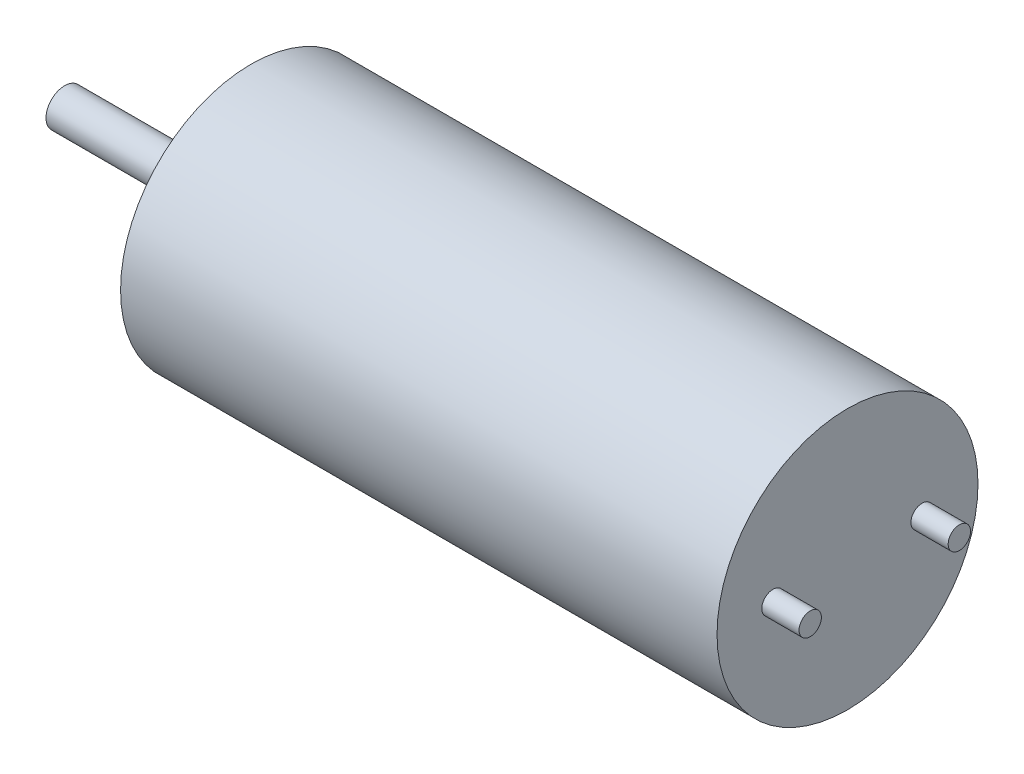
ISO-10303-21;
HEADER;
FILE_DESCRIPTION(('STEP AP214'),'2;1');
FILE_NAME('part.step','',(''),(''),'','','');
FILE_SCHEMA(('AUTOMOTIVE_DESIGN { 1 0 10303 214 1 1 1 1 }'));
ENDSEC;
DATA;
#1=APPLICATION_CONTEXT('core data for automotive mechanical design processes');
#2=APPLICATION_PROTOCOL_DEFINITION('international standard','automotive_design',2000,#1);
#3=PRODUCT_CONTEXT('',#1,'mechanical');
#4=PRODUCT('Part','Part','',(#3));
#5=PRODUCT_RELATED_PRODUCT_CATEGORY('part','',(#4));
#6=PRODUCT_DEFINITION_FORMATION('','',#4);
#7=PRODUCT_DEFINITION_CONTEXT('part definition',#1,'design');
#8=PRODUCT_DEFINITION('design','',#6,#7);
#9=PRODUCT_DEFINITION_SHAPE('','',#8);
#10=(LENGTH_UNIT() NAMED_UNIT(*) SI_UNIT(.MILLI.,.METRE.));
#11=(NAMED_UNIT(*) PLANE_ANGLE_UNIT() SI_UNIT($,.RADIAN.));
#12=(NAMED_UNIT(*) SI_UNIT($,.STERADIAN.) SOLID_ANGLE_UNIT());
#13=UNCERTAINTY_MEASURE_WITH_UNIT(LENGTH_MEASURE(1.E-05),#10,'distance_accuracy_value','');
#14=(GEOMETRIC_REPRESENTATION_CONTEXT(3) GLOBAL_UNCERTAINTY_ASSIGNED_CONTEXT((#13)) GLOBAL_UNIT_ASSIGNED_CONTEXT((#10,
#11,#12)) REPRESENTATION_CONTEXT('',''));
#15=CARTESIAN_POINT('',(0.,0.,0.));
#16=DIRECTION('',(0.,0.,1.));
#17=DIRECTION('',(1.,0.,0.));
#18=AXIS2_PLACEMENT_3D('',#15,#16,#17);
#19=CARTESIAN_POINT('',(16.,0.,0.));
#20=DIRECTION('',(-1.,0.,0.));
#21=DIRECTION('',(0.,0.,1.));
#22=AXIS2_PLACEMENT_3D('',#19,#20,#21);
#23=CYLINDRICAL_SURFACE('',#22,3.5);
#24=CARTESIAN_POINT('',(16.,0.,0.));
#25=DIRECTION('',(1.,0.,0.));
#26=DIRECTION('',(0.,0.,-1.));
#27=AXIS2_PLACEMENT_3D('',#24,#25,#26);
#28=CIRCLE('',#27,3.5);
#29=CARTESIAN_POINT('',(16.,0.,-3.5));
#30=VERTEX_POINT('',#29);
#31=EDGE_CURVE('E47',#30,#30,#28,.T.);
#32=ORIENTED_EDGE('',*,*,#31,.F.);
#33=EDGE_LOOP('',(#32));
#34=FACE_BOUND('',#33,.T.);
#35=CARTESIAN_POINT('',(0.,0.,0.));
#36=DIRECTION('',(1.,0.,0.));
#37=DIRECTION('',(0.,0.,-1.));
#38=AXIS2_PLACEMENT_3D('',#35,#36,#37);
#39=CIRCLE('',#38,3.5);
#40=CARTESIAN_POINT('',(0.,0.,-3.5));
#41=VERTEX_POINT('',#40);
#42=EDGE_CURVE('E38',#41,#41,#39,.T.);
#43=ORIENTED_EDGE('',*,*,#42,.T.);
#44=EDGE_LOOP('',(#43));
#45=FACE_BOUND('',#44,.T.);
#46=ADVANCED_FACE('F35',(#34,#45),#23,.T.);
#47=CARTESIAN_POINT('',(16.,0.,0.));
#48=DIRECTION('',(1.,0.,0.));
#49=DIRECTION('',(0.,0.,-1.));
#50=AXIS2_PLACEMENT_3D('',#47,#48,#49);
#51=PLANE('',#50);
#52=CARTESIAN_POINT('',(16.,0.,-2.));
#53=DIRECTION('',(1.,0.,0.));
#54=DIRECTION('',(0.,0.,-1.));
#55=AXIS2_PLACEMENT_3D('',#52,#53,#54);
#56=CIRCLE('',#55,0.3);
#57=CARTESIAN_POINT('',(16.,0.,-2.3));
#58=VERTEX_POINT('',#57);
#59=EDGE_CURVE('E182',#58,#58,#56,.T.);
#60=ORIENTED_EDGE('',*,*,#59,.F.);
#61=EDGE_LOOP('',(#60));
#62=FACE_BOUND('',#61,.T.);
#63=CARTESIAN_POINT('',(16.,0.,2.));
#64=DIRECTION('',(1.,0.,0.));
#65=DIRECTION('',(0.,0.,-1.));
#66=AXIS2_PLACEMENT_3D('',#63,#64,#65);
#67=CIRCLE('',#66,0.3);
#68=CARTESIAN_POINT('',(16.,0.,1.7));
#69=VERTEX_POINT('',#68);
#70=EDGE_CURVE('E176',#69,#69,#67,.T.);
#71=ORIENTED_EDGE('',*,*,#70,.F.);
#72=EDGE_LOOP('',(#71));
#73=FACE_BOUND('',#72,.T.);
#74=ORIENTED_EDGE('',*,*,#31,.T.);
#75=EDGE_LOOP('',(#74));
#76=FACE_BOUND('',#75,.T.);
#77=ADVANCED_FACE('F65',(#62,#73,#76),#51,.T.);
#78=CARTESIAN_POINT('',(0.,0.,0.));
#79=DIRECTION('',(1.,0.,0.));
#80=DIRECTION('',(0.,0.,-1.));
#81=AXIS2_PLACEMENT_3D('',#78,#79,#80);
#82=PLANE('',#81);
#83=CARTESIAN_POINT('',(0.,0.,0.));
#84=DIRECTION('',(-1.,0.,0.));
#85=DIRECTION('',(0.,0.,1.));
#86=AXIS2_PLACEMENT_3D('',#83,#84,#85);
#87=CIRCLE('',#86,1.2);
#88=CARTESIAN_POINT('',(0.,0.,1.2));
#89=VERTEX_POINT('',#88);
#90=EDGE_CURVE('E42',#89,#89,#87,.T.);
#91=ORIENTED_EDGE('',*,*,#90,.F.);
#92=EDGE_LOOP('',(#91));
#93=FACE_BOUND('',#92,.T.);
#94=ORIENTED_EDGE('',*,*,#42,.F.);
#95=EDGE_LOOP('',(#94));
#96=FACE_BOUND('',#95,.T.);
#97=ADVANCED_FACE('F62',(#93,#96),#82,.F.);
#98=CARTESIAN_POINT('',(-0.8,0.,0.));
#99=DIRECTION('',(1.,0.,0.));
#100=DIRECTION('',(0.,0.,-1.));
#101=AXIS2_PLACEMENT_3D('',#98,#99,#100);
#102=CYLINDRICAL_SURFACE('',#101,1.2);
#103=CARTESIAN_POINT('',(-0.8,0.,0.));
#104=DIRECTION('',(-1.,0.,0.));
#105=DIRECTION('',(0.,0.,1.));
#106=AXIS2_PLACEMENT_3D('',#103,#104,#105);
#107=CIRCLE('',#106,1.2);
#108=CARTESIAN_POINT('',(-0.8,0.,1.2));
#109=VERTEX_POINT('',#108);
#110=EDGE_CURVE('E53',#109,#109,#107,.T.);
#111=ORIENTED_EDGE('',*,*,#110,.F.);
#112=EDGE_LOOP('',(#111));
#113=FACE_BOUND('',#112,.T.);
#114=ORIENTED_EDGE('',*,*,#90,.T.);
#115=EDGE_LOOP('',(#114));
#116=FACE_BOUND('',#115,.T.);
#117=ADVANCED_FACE('F64',(#113,#116),#102,.T.);
#118=CARTESIAN_POINT('',(-0.8,0.,0.));
#119=DIRECTION('',(-1.,0.,0.));
#120=DIRECTION('',(0.,0.,1.));
#121=AXIS2_PLACEMENT_3D('',#118,#119,#120);
#122=PLANE('',#121);
#123=CARTESIAN_POINT('',(-0.8,0.,0.));
#124=DIRECTION('',(-1.,0.,0.));
#125=DIRECTION('',(0.,0.,1.));
#126=AXIS2_PLACEMENT_3D('',#123,#124,#125);
#127=CIRCLE('',#126,0.5);
#128=CARTESIAN_POINT('',(-0.8,0.,0.5));
#129=VERTEX_POINT('',#128);
#130=EDGE_CURVE('E10',#129,#129,#127,.T.);
#131=ORIENTED_EDGE('',*,*,#130,.F.);
#132=EDGE_LOOP('',(#131));
#133=FACE_BOUND('',#132,.T.);
#134=ORIENTED_EDGE('',*,*,#110,.T.);
#135=EDGE_LOOP('',(#134));
#136=FACE_BOUND('',#135,.T.);
#137=ADVANCED_FACE('F71',(#133,#136),#122,.T.);
#138=CARTESIAN_POINT('',(-5.,0.,0.));
#139=DIRECTION('',(1.,0.,0.));
#140=DIRECTION('',(0.,0.,-1.));
#141=AXIS2_PLACEMENT_3D('',#138,#139,#140);
#142=CYLINDRICAL_SURFACE('',#141,0.5);
#143=CARTESIAN_POINT('',(-5.,0.,0.));
#144=DIRECTION('',(-1.,0.,0.));
#145=DIRECTION('',(0.,0.,1.));
#146=AXIS2_PLACEMENT_3D('',#143,#144,#145);
#147=CIRCLE('',#146,0.5);
#148=CARTESIAN_POINT('',(-5.,0.,0.5));
#149=VERTEX_POINT('',#148);
#150=EDGE_CURVE('E51',#149,#149,#147,.T.);
#151=ORIENTED_EDGE('',*,*,#150,.F.);
#152=EDGE_LOOP('',(#151));
#153=FACE_BOUND('',#152,.T.);
#154=ORIENTED_EDGE('',*,*,#130,.T.);
#155=EDGE_LOOP('',(#154));
#156=FACE_BOUND('',#155,.T.);
#157=ADVANCED_FACE('F139',(#153,#156),#142,.T.);
#158=CARTESIAN_POINT('',(-5.,0.,0.));
#159=DIRECTION('',(-1.,0.,0.));
#160=DIRECTION('',(0.,0.,1.));
#161=AXIS2_PLACEMENT_3D('',#158,#159,#160);
#162=PLANE('',#161);
#163=ORIENTED_EDGE('',*,*,#150,.T.);
#164=EDGE_LOOP('',(#163));
#165=FACE_BOUND('',#164,.T.);
#166=ADVANCED_FACE('F92',(#165),#162,.T.);
#167=CARTESIAN_POINT('',(17.,0.,2.));
#168=DIRECTION('',(-1.,0.,0.));
#169=DIRECTION('',(0.,0.,1.));
#170=AXIS2_PLACEMENT_3D('',#167,#168,#169);
#171=CYLINDRICAL_SURFACE('',#170,0.3);
#172=CARTESIAN_POINT('',(17.,0.,2.));
#173=DIRECTION('',(1.,0.,0.));
#174=DIRECTION('',(0.,0.,-1.));
#175=AXIS2_PLACEMENT_3D('',#172,#173,#174);
#176=CIRCLE('',#175,0.3);
#177=CARTESIAN_POINT('',(17.,0.,1.7));
#178=VERTEX_POINT('',#177);
#179=EDGE_CURVE('E174',#178,#178,#176,.T.);
#180=ORIENTED_EDGE('',*,*,#179,.F.);
#181=EDGE_LOOP('',(#180));
#182=FACE_BOUND('',#181,.T.);
#183=ORIENTED_EDGE('',*,*,#70,.T.);
#184=EDGE_LOOP('',(#183));
#185=FACE_BOUND('',#184,.T.);
#186=ADVANCED_FACE('F97',(#182,#185),#171,.T.);
#187=CARTESIAN_POINT('',(17.,0.,2.));
#188=DIRECTION('',(1.,0.,0.));
#189=DIRECTION('',(0.,0.,-1.));
#190=AXIS2_PLACEMENT_3D('',#187,#188,#189);
#191=PLANE('',#190);
#192=ORIENTED_EDGE('',*,*,#179,.T.);
#193=EDGE_LOOP('',(#192));
#194=FACE_BOUND('',#193,.T.);
#195=ADVANCED_FACE('F102',(#194),#191,.T.);
#196=CARTESIAN_POINT('',(17.,0.,-2.));
#197=DIRECTION('',(-1.,0.,0.));
#198=DIRECTION('',(0.,0.,1.));
#199=AXIS2_PLACEMENT_3D('',#196,#197,#198);
#200=CYLINDRICAL_SURFACE('',#199,0.3);
#201=CARTESIAN_POINT('',(17.,0.,-2.));
#202=DIRECTION('',(1.,0.,0.));
#203=DIRECTION('',(0.,0.,-1.));
#204=AXIS2_PLACEMENT_3D('',#201,#202,#203);
#205=CIRCLE('',#204,0.3);
#206=CARTESIAN_POINT('',(17.,0.,-2.3));
#207=VERTEX_POINT('',#206);
#208=EDGE_CURVE('E180',#207,#207,#205,.T.);
#209=ORIENTED_EDGE('',*,*,#208,.F.);
#210=EDGE_LOOP('',(#209));
#211=FACE_BOUND('',#210,.T.);
#212=ORIENTED_EDGE('',*,*,#59,.T.);
#213=EDGE_LOOP('',(#212));
#214=FACE_BOUND('',#213,.T.);
#215=ADVANCED_FACE('F112',(#211,#214),#200,.T.);
#216=CARTESIAN_POINT('',(17.,0.,-2.));
#217=DIRECTION('',(1.,0.,0.));
#218=DIRECTION('',(0.,0.,-1.));
#219=AXIS2_PLACEMENT_3D('',#216,#217,#218);
#220=PLANE('',#219);
#221=ORIENTED_EDGE('',*,*,#208,.T.);
#222=EDGE_LOOP('',(#221));
#223=FACE_BOUND('',#222,.T.);
#224=ADVANCED_FACE('F122',(#223),#220,.T.);
#225=CLOSED_SHELL('',(#46,#77,#97,#117,#137,#157,#166,#186,#195,#215,#224));
#226=MANIFOLD_SOLID_BREP('B2',#225);
#227=ADVANCED_BREP_SHAPE_REPRESENTATION('',(#18,#226),#14);
#228=SHAPE_DEFINITION_REPRESENTATION(#9,#227);
ENDSEC;
END-ISO-10303-21;
